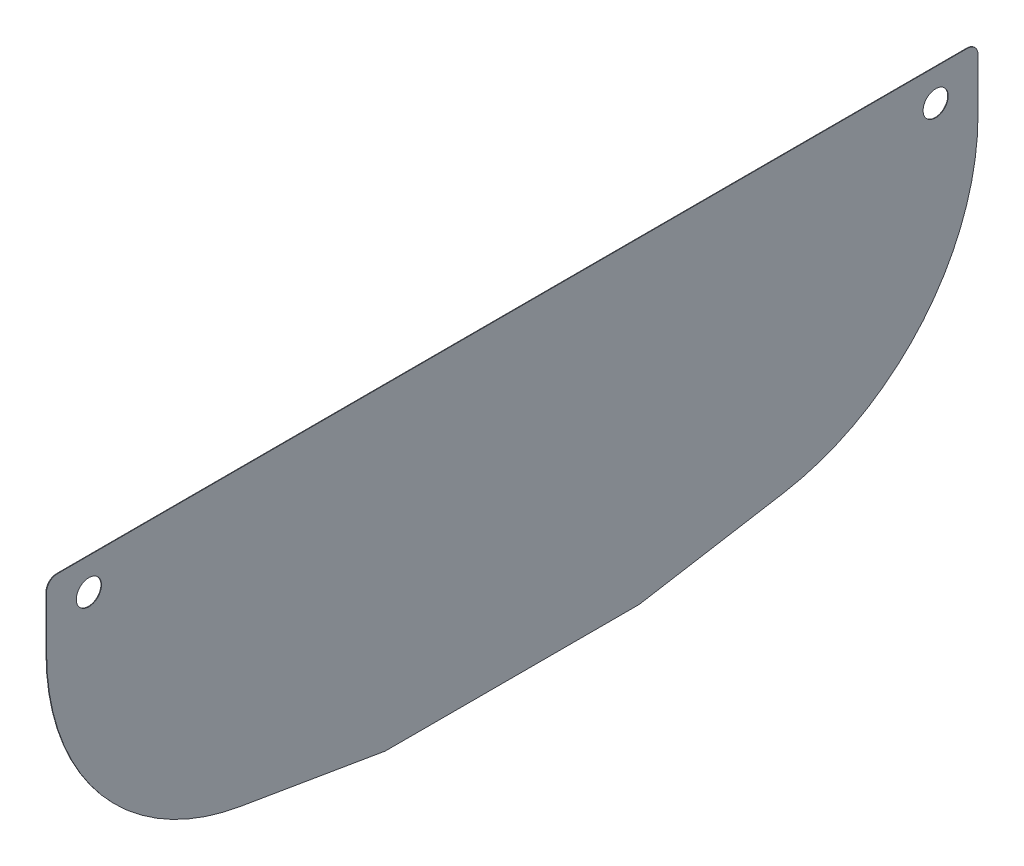
ISO-10303-21;
HEADER;
FILE_DESCRIPTION(('STEP AP214'),'2;1');
FILE_NAME('part.step','',(''),(''),'','','');
FILE_SCHEMA(('AUTOMOTIVE_DESIGN { 1 0 10303 214 1 1 1 1 }'));
ENDSEC;
DATA;
#1=APPLICATION_CONTEXT('core data for automotive mechanical design processes');
#2=APPLICATION_PROTOCOL_DEFINITION('international standard','automotive_design',2000,#1);
#3=PRODUCT_CONTEXT('',#1,'mechanical');
#4=PRODUCT('Part','Part','',(#3));
#5=PRODUCT_RELATED_PRODUCT_CATEGORY('part','',(#4));
#6=PRODUCT_DEFINITION_FORMATION('','',#4);
#7=PRODUCT_DEFINITION_CONTEXT('part definition',#1,'design');
#8=PRODUCT_DEFINITION('design','',#6,#7);
#9=PRODUCT_DEFINITION_SHAPE('','',#8);
#10=(LENGTH_UNIT() NAMED_UNIT(*) SI_UNIT(.MILLI.,.METRE.));
#11=(NAMED_UNIT(*) PLANE_ANGLE_UNIT() SI_UNIT($,.RADIAN.));
#12=(NAMED_UNIT(*) SI_UNIT($,.STERADIAN.) SOLID_ANGLE_UNIT());
#13=UNCERTAINTY_MEASURE_WITH_UNIT(LENGTH_MEASURE(1.E-05),#10,'distance_accuracy_value','');
#14=(GEOMETRIC_REPRESENTATION_CONTEXT(3) GLOBAL_UNCERTAINTY_ASSIGNED_CONTEXT((#13)) GLOBAL_UNIT_ASSIGNED_CONTEXT((#10,
#11,#12)) REPRESENTATION_CONTEXT('',''));
#15=CARTESIAN_POINT('',(0.,0.,0.));
#16=DIRECTION('',(0.,0.,1.));
#17=DIRECTION('',(1.,0.,0.));
#18=AXIS2_PLACEMENT_3D('',#15,#16,#17);
#19=CARTESIAN_POINT('',(0.635,609.6,-279.4));
#20=DIRECTION('',(1.,0.,0.));
#21=DIRECTION('',(0.,0.,-1.));
#22=AXIS2_PLACEMENT_3D('',#19,#20,#21);
#23=PLANE('',#22);
#24=CARTESIAN_POINT('',(0.635,647.7,508.));
#25=DIRECTION('',(1.,0.,0.));
#26=DIRECTION('',(0.,0.,-1.));
#27=AXIS2_PLACEMENT_3D('',#24,#25,#26);
#28=CIRCLE('',#27,15.08125);
#29=CARTESIAN_POINT('',(0.635,647.7,492.91875));
#30=VERTEX_POINT('',#29);
#31=EDGE_CURVE('E243',#30,#30,#28,.T.);
#32=ORIENTED_EDGE('',*,*,#31,.F.);
#33=EDGE_LOOP('',(#32));
#34=FACE_BOUND('',#33,.T.);
#35=DIRECTION('',(0.,0.,-1.));
#36=VECTOR('',#35,1.);
#37=CARTESIAN_POINT('',(0.635,304.8,-152.4));
#38=LINE('',#37,#36);
#39=CARTESIAN_POINT('',(0.635,304.8,151.335296477196));
#40=VERTEX_POINT('',#39);
#41=CARTESIAN_POINT('',(0.635,304.8,-151.335296477196));
#42=VERTEX_POINT('',#41);
#43=EDGE_CURVE('E236',#40,#42,#38,.T.);
#44=ORIENTED_EDGE('',*,*,#43,.T.);
#45=CARTESIAN_POINT('',(0.635,317.5,-151.335296477196));
#46=DIRECTION('',(1.,0.,0.));
#47=DIRECTION('',(0.,0.,-1.));
#48=AXIS2_PLACEMENT_3D('',#45,#46,#47);
#49=CIRCLE('',#48,12.7);
#50=CARTESIAN_POINT('',(0.635,304.977272750754,-153.449841875385));
#51=VERTEX_POINT('',#50);
#52=EDGE_CURVE('E182',#42,#51,#49,.T.);
#53=ORIENTED_EDGE('',*,*,#52,.T.);
#54=DIRECTION('',(0.,0.166499637652699,-0.986041515688625));
#55=VECTOR('',#54,1.);
#56=CARTESIAN_POINT('',(0.635,304.8,-152.4));
#57=LINE('',#56,#55);
#58=CARTESIAN_POINT('',(0.635,334.100000516598,-325.919998760164));
#59=VERTEX_POINT('',#58);
#60=EDGE_CURVE('E145',#51,#59,#57,.T.);
#61=ORIENTED_EDGE('',*,*,#60,.T.);
#62=CARTESIAN_POINT('',(0.635,609.6,-279.4));
#63=DIRECTION('',(1.,0.,0.));
#64=DIRECTION('',(0.,0.,-1.));
#65=AXIS2_PLACEMENT_3D('',#62,#63,#64);
#66=CIRCLE('',#65,279.4);
#67=CARTESIAN_POINT('',(0.635,609.6,-558.8));
#68=VERTEX_POINT('',#67);
#69=EDGE_CURVE('E139',#59,#68,#66,.T.);
#70=ORIENTED_EDGE('',*,*,#69,.T.);
#71=DIRECTION('',(0.,1.,0.));
#72=VECTOR('',#71,1.);
#73=CARTESIAN_POINT('',(0.635,685.8,-558.8));
#74=LINE('',#73,#72);
#75=CARTESIAN_POINT('',(0.635,673.1,-558.8));
#76=VERTEX_POINT('',#75);
#77=EDGE_CURVE('E129',#68,#76,#74,.T.);
#78=ORIENTED_EDGE('',*,*,#77,.T.);
#79=CARTESIAN_POINT('',(0.635,673.1,-546.1));
#80=DIRECTION('',(1.,0.,0.));
#81=DIRECTION('',(0.,0.,-1.));
#82=AXIS2_PLACEMENT_3D('',#79,#80,#81);
#83=CIRCLE('',#82,12.7);
#84=CARTESIAN_POINT('',(0.635,685.8,-546.1));
#85=VERTEX_POINT('',#84);
#86=EDGE_CURVE('E178',#76,#85,#83,.T.);
#87=ORIENTED_EDGE('',*,*,#86,.T.);
#88=DIRECTION('',(0.,0.,1.));
#89=VECTOR('',#88,1.);
#90=CARTESIAN_POINT('',(0.635,685.8,558.8));
#91=LINE('',#90,#89);
#92=CARTESIAN_POINT('',(0.635,685.8,546.1));
#93=VERTEX_POINT('',#92);
#94=EDGE_CURVE('E138',#85,#93,#91,.T.);
#95=ORIENTED_EDGE('',*,*,#94,.T.);
#96=CARTESIAN_POINT('',(0.635,673.1,546.1));
#97=DIRECTION('',(1.,0.,0.));
#98=DIRECTION('',(0.,0.,-1.));
#99=AXIS2_PLACEMENT_3D('',#96,#97,#98);
#100=CIRCLE('',#99,12.7);
#101=CARTESIAN_POINT('',(0.635,673.1,558.8));
#102=VERTEX_POINT('',#101);
#103=EDGE_CURVE('E60',#93,#102,#100,.T.);
#104=ORIENTED_EDGE('',*,*,#103,.T.);
#105=DIRECTION('',(0.,-1.,0.));
#106=VECTOR('',#105,1.);
#107=CARTESIAN_POINT('',(0.635,609.6,558.8));
#108=LINE('',#107,#106);
#109=CARTESIAN_POINT('',(0.635,609.6,558.8));
#110=VERTEX_POINT('',#109);
#111=EDGE_CURVE('E257',#102,#110,#108,.T.);
#112=ORIENTED_EDGE('',*,*,#111,.T.);
#113=CARTESIAN_POINT('',(0.635,609.6,279.4));
#114=DIRECTION('',(1.,0.,0.));
#115=DIRECTION('',(0.,0.,1.));
#116=AXIS2_PLACEMENT_3D('',#113,#114,#115);
#117=CIRCLE('',#116,279.4);
#118=CARTESIAN_POINT('',(0.635,334.100000516598,325.919998760164));
#119=VERTEX_POINT('',#118);
#120=EDGE_CURVE('E240',#110,#119,#117,.T.);
#121=ORIENTED_EDGE('',*,*,#120,.T.);
#122=DIRECTION('',(0.,-0.166499637652699,-0.986041515688625));
#123=VECTOR('',#122,1.);
#124=CARTESIAN_POINT('',(0.635,304.8,152.4));
#125=LINE('',#124,#123);
#126=CARTESIAN_POINT('',(0.635,304.977272750754,153.449841875385));
#127=VERTEX_POINT('',#126);
#128=EDGE_CURVE('E223',#119,#127,#125,.T.);
#129=ORIENTED_EDGE('',*,*,#128,.T.);
#130=CARTESIAN_POINT('',(0.635,317.5,151.335296477196));
#131=DIRECTION('',(1.,0.,0.));
#132=DIRECTION('',(0.,0.,-1.));
#133=AXIS2_PLACEMENT_3D('',#130,#131,#132);
#134=CIRCLE('',#133,12.7);
#135=EDGE_CURVE('E180',#127,#40,#134,.T.);
#136=ORIENTED_EDGE('',*,*,#135,.T.);
#137=EDGE_LOOP('',(#44,#53,#61,#70,#78,#87,#95,#104,#112,#121,#129,#136));
#138=FACE_BOUND('',#137,.T.);
#139=CARTESIAN_POINT('',(0.635,647.7,-508.));
#140=DIRECTION('',(1.,0.,0.));
#141=DIRECTION('',(0.,0.,-1.));
#142=AXIS2_PLACEMENT_3D('',#139,#140,#141);
#143=CIRCLE('',#142,15.0812500000001);
#144=CARTESIAN_POINT('',(0.635,647.7,-523.08125));
#145=VERTEX_POINT('',#144);
#146=EDGE_CURVE('E250',#145,#145,#143,.T.);
#147=ORIENTED_EDGE('',*,*,#146,.F.);
#148=EDGE_LOOP('',(#147));
#149=FACE_BOUND('',#148,.T.);
#150=ADVANCED_FACE('F37',(#34,#138,#149),#23,.T.);
#151=CARTESIAN_POINT('',(0.,609.6,-279.4));
#152=DIRECTION('',(1.,0.,0.));
#153=DIRECTION('',(0.,0.,-1.));
#154=AXIS2_PLACEMENT_3D('',#151,#152,#153);
#155=PLANE('',#154);
#156=DIRECTION('',(0.,0.166499637652699,-0.986041515688625));
#157=VECTOR('',#156,1.);
#158=CARTESIAN_POINT('',(0.,304.8,-152.4));
#159=LINE('',#158,#157);
#160=CARTESIAN_POINT('',(0.,304.977272750754,-153.449841875385));
#161=VERTEX_POINT('',#160);
#162=CARTESIAN_POINT('',(0.,334.100000516598,-325.919998760164));
#163=VERTEX_POINT('',#162);
#164=EDGE_CURVE('E149',#161,#163,#159,.T.);
#165=ORIENTED_EDGE('',*,*,#164,.F.);
#166=CARTESIAN_POINT('',(0.,317.5,-151.335296477196));
#167=DIRECTION('',(1.,0.,0.));
#168=DIRECTION('',(0.,0.,-1.));
#169=AXIS2_PLACEMENT_3D('',#166,#167,#168);
#170=CIRCLE('',#169,12.7);
#171=CARTESIAN_POINT('',(0.,304.8,-151.335296477196));
#172=VERTEX_POINT('',#171);
#173=EDGE_CURVE('E170',#161,#172,#170,.F.);
#174=ORIENTED_EDGE('',*,*,#173,.T.);
#175=DIRECTION('',(0.,0.,-1.));
#176=VECTOR('',#175,1.);
#177=CARTESIAN_POINT('',(0.,304.8,-152.4));
#178=LINE('',#177,#176);
#179=CARTESIAN_POINT('',(0.,304.8,151.335296477196));
#180=VERTEX_POINT('',#179);
#181=EDGE_CURVE('E214',#180,#172,#178,.T.);
#182=ORIENTED_EDGE('',*,*,#181,.F.);
#183=CARTESIAN_POINT('',(0.,317.5,151.335296477196));
#184=DIRECTION('',(1.,0.,0.));
#185=DIRECTION('',(0.,0.,-1.));
#186=AXIS2_PLACEMENT_3D('',#183,#184,#185);
#187=CIRCLE('',#186,12.7);
#188=CARTESIAN_POINT('',(0.,304.977272750754,153.449841875385));
#189=VERTEX_POINT('',#188);
#190=EDGE_CURVE('E168',#180,#189,#187,.F.);
#191=ORIENTED_EDGE('',*,*,#190,.T.);
#192=DIRECTION('',(0.,-0.166499637652699,-0.986041515688625));
#193=VECTOR('',#192,1.);
#194=CARTESIAN_POINT('',(0.,304.8,152.4));
#195=LINE('',#194,#193);
#196=CARTESIAN_POINT('',(0.,334.100000516598,325.919998760164));
#197=VERTEX_POINT('',#196);
#198=EDGE_CURVE('E212',#197,#189,#195,.T.);
#199=ORIENTED_EDGE('',*,*,#198,.F.);
#200=CARTESIAN_POINT('',(0.,609.6,279.4));
#201=DIRECTION('',(1.,0.,0.));
#202=DIRECTION('',(0.,0.,1.));
#203=AXIS2_PLACEMENT_3D('',#200,#201,#202);
#204=CIRCLE('',#203,279.4);
#205=CARTESIAN_POINT('',(0.,609.6,558.8));
#206=VERTEX_POINT('',#205);
#207=EDGE_CURVE('E206',#206,#197,#204,.T.);
#208=ORIENTED_EDGE('',*,*,#207,.F.);
#209=DIRECTION('',(0.,-1.,0.));
#210=VECTOR('',#209,1.);
#211=CARTESIAN_POINT('',(0.,609.6,558.8));
#212=LINE('',#211,#210);
#213=CARTESIAN_POINT('',(0.,673.1,558.8));
#214=VERTEX_POINT('',#213);
#215=EDGE_CURVE('E203',#214,#206,#212,.T.);
#216=ORIENTED_EDGE('',*,*,#215,.F.);
#217=CARTESIAN_POINT('',(0.,673.1,546.1));
#218=DIRECTION('',(1.,0.,0.));
#219=DIRECTION('',(0.,0.,-1.));
#220=AXIS2_PLACEMENT_3D('',#217,#218,#219);
#221=CIRCLE('',#220,12.7);
#222=CARTESIAN_POINT('',(0.,685.8,546.1));
#223=VERTEX_POINT('',#222);
#224=EDGE_CURVE('E158',#214,#223,#221,.F.);
#225=ORIENTED_EDGE('',*,*,#224,.T.);
#226=DIRECTION('',(0.,0.,1.));
#227=VECTOR('',#226,1.);
#228=CARTESIAN_POINT('',(0.,685.8,558.8));
#229=LINE('',#228,#227);
#230=CARTESIAN_POINT('',(0.,685.8,-546.1));
#231=VERTEX_POINT('',#230);
#232=EDGE_CURVE('E195',#231,#223,#229,.T.);
#233=ORIENTED_EDGE('',*,*,#232,.F.);
#234=CARTESIAN_POINT('',(0.,673.1,-546.1));
#235=DIRECTION('',(1.,0.,0.));
#236=DIRECTION('',(0.,0.,-1.));
#237=AXIS2_PLACEMENT_3D('',#234,#235,#236);
#238=CIRCLE('',#237,12.7);
#239=CARTESIAN_POINT('',(0.,673.1,-558.8));
#240=VERTEX_POINT('',#239);
#241=EDGE_CURVE('E166',#231,#240,#238,.F.);
#242=ORIENTED_EDGE('',*,*,#241,.T.);
#243=DIRECTION('',(0.,1.,0.));
#244=VECTOR('',#243,1.);
#245=CARTESIAN_POINT('',(0.,685.8,-558.8));
#246=LINE('',#245,#244);
#247=CARTESIAN_POINT('',(0.,609.6,-558.8));
#248=VERTEX_POINT('',#247);
#249=EDGE_CURVE('E204',#248,#240,#246,.T.);
#250=ORIENTED_EDGE('',*,*,#249,.F.);
#251=CARTESIAN_POINT('',(0.,609.6,-279.4));
#252=DIRECTION('',(1.,0.,0.));
#253=DIRECTION('',(0.,0.,-1.));
#254=AXIS2_PLACEMENT_3D('',#251,#252,#253);
#255=CIRCLE('',#254,279.4);
#256=EDGE_CURVE('E153',#163,#248,#255,.T.);
#257=ORIENTED_EDGE('',*,*,#256,.F.);
#258=EDGE_LOOP('',(#165,#174,#182,#191,#199,#208,#216,#225,#233,#242,#250,#257));
#259=FACE_BOUND('',#258,.T.);
#260=CARTESIAN_POINT('',(0.,647.7,508.));
#261=DIRECTION('',(1.,0.,0.));
#262=DIRECTION('',(0.,0.,-1.));
#263=AXIS2_PLACEMENT_3D('',#260,#261,#262);
#264=CIRCLE('',#263,15.08125);
#265=CARTESIAN_POINT('',(0.,647.7,492.91875));
#266=VERTEX_POINT('',#265);
#267=EDGE_CURVE('E245',#266,#266,#264,.T.);
#268=ORIENTED_EDGE('',*,*,#267,.T.);
#269=EDGE_LOOP('',(#268));
#270=FACE_BOUND('',#269,.T.);
#271=CARTESIAN_POINT('',(0.,647.7,-508.));
#272=DIRECTION('',(1.,0.,0.));
#273=DIRECTION('',(0.,0.,-1.));
#274=AXIS2_PLACEMENT_3D('',#271,#272,#273);
#275=CIRCLE('',#274,15.0812500000001);
#276=CARTESIAN_POINT('',(0.,647.7,-523.08125));
#277=VERTEX_POINT('',#276);
#278=EDGE_CURVE('E253',#277,#277,#275,.T.);
#279=ORIENTED_EDGE('',*,*,#278,.T.);
#280=EDGE_LOOP('',(#279));
#281=FACE_BOUND('',#280,.T.);
#282=ADVANCED_FACE('F200',(#259,#270,#281),#155,.F.);
#283=CARTESIAN_POINT('',(0.635,609.6,-279.4));
#284=DIRECTION('',(-1.,0.,0.));
#285=DIRECTION('',(0.,0.,1.));
#286=AXIS2_PLACEMENT_3D('',#283,#284,#285);
#287=CYLINDRICAL_SURFACE('',#286,279.4);
#288=ORIENTED_EDGE('',*,*,#256,.T.);
#289=DIRECTION('',(-1.,0.,0.));
#290=VECTOR('',#289,1.);
#291=CARTESIAN_POINT('',(0.635,609.6,-558.8));
#292=LINE('',#291,#290);
#293=EDGE_CURVE('E134',#68,#248,#292,.T.);
#294=ORIENTED_EDGE('',*,*,#293,.F.);
#295=ORIENTED_EDGE('',*,*,#69,.F.);
#296=DIRECTION('',(-1.,0.,0.));
#297=VECTOR('',#296,1.);
#298=CARTESIAN_POINT('',(0.635,334.100000516598,-325.919998760164));
#299=LINE('',#298,#297);
#300=EDGE_CURVE('E218',#59,#163,#299,.T.);
#301=ORIENTED_EDGE('',*,*,#300,.T.);
#302=EDGE_LOOP('',(#288,#294,#295,#301));
#303=FACE_BOUND('',#302,.T.);
#304=ADVANCED_FACE('F151',(#303),#287,.T.);
#305=CARTESIAN_POINT('',(0.635,685.8,-558.8));
#306=DIRECTION('',(0.,0.,1.));
#307=DIRECTION('',(0.,-1.,0.));
#308=AXIS2_PLACEMENT_3D('',#305,#306,#307);
#309=PLANE('',#308);
#310=ORIENTED_EDGE('',*,*,#249,.T.);
#311=DIRECTION('',(-1.,0.,0.));
#312=VECTOR('',#311,1.);
#313=CARTESIAN_POINT('',(0.635,673.1,-558.8));
#314=LINE('',#313,#312);
#315=EDGE_CURVE('E45',#240,#76,#314,.F.);
#316=ORIENTED_EDGE('',*,*,#315,.T.);
#317=ORIENTED_EDGE('',*,*,#77,.F.);
#318=ORIENTED_EDGE('',*,*,#293,.T.);
#319=EDGE_LOOP('',(#310,#316,#317,#318));
#320=FACE_BOUND('',#319,.T.);
#321=ADVANCED_FACE('F132',(#320),#309,.F.);
#322=CARTESIAN_POINT('',(0.635,685.8,558.8));
#323=DIRECTION('',(0.,-1.,0.));
#324=DIRECTION('',(0.,0.,-1.));
#325=AXIS2_PLACEMENT_3D('',#322,#323,#324);
#326=PLANE('',#325);
#327=ORIENTED_EDGE('',*,*,#94,.F.);
#328=DIRECTION('',(-1.,0.,0.));
#329=VECTOR('',#328,1.);
#330=CARTESIAN_POINT('',(0.635,685.8,-546.1));
#331=LINE('',#330,#329);
#332=EDGE_CURVE('E187',#85,#231,#331,.T.);
#333=ORIENTED_EDGE('',*,*,#332,.T.);
#334=ORIENTED_EDGE('',*,*,#232,.T.);
#335=DIRECTION('',(-1.,0.,0.));
#336=VECTOR('',#335,1.);
#337=CARTESIAN_POINT('',(0.635,685.8,546.1));
#338=LINE('',#337,#336);
#339=EDGE_CURVE('E185',#223,#93,#338,.F.);
#340=ORIENTED_EDGE('',*,*,#339,.T.);
#341=EDGE_LOOP('',(#327,#333,#334,#340));
#342=FACE_BOUND('',#341,.T.);
#343=ADVANCED_FACE('F194',(#342),#326,.F.);
#344=CARTESIAN_POINT('',(0.635,609.6,558.8));
#345=DIRECTION('',(0.,0.,-1.));
#346=DIRECTION('',(0.,1.,0.));
#347=AXIS2_PLACEMENT_3D('',#344,#345,#346);
#348=PLANE('',#347);
#349=ORIENTED_EDGE('',*,*,#111,.F.);
#350=DIRECTION('',(-1.,0.,0.));
#351=VECTOR('',#350,1.);
#352=CARTESIAN_POINT('',(0.635,673.1,558.8));
#353=LINE('',#352,#351);
#354=EDGE_CURVE('E11',#102,#214,#353,.T.);
#355=ORIENTED_EDGE('',*,*,#354,.T.);
#356=ORIENTED_EDGE('',*,*,#215,.T.);
#357=DIRECTION('',(-1.,0.,0.));
#358=VECTOR('',#357,1.);
#359=CARTESIAN_POINT('',(0.635,609.6,558.8));
#360=LINE('',#359,#358);
#361=EDGE_CURVE('E155',#110,#206,#360,.T.);
#362=ORIENTED_EDGE('',*,*,#361,.F.);
#363=EDGE_LOOP('',(#349,#355,#356,#362));
#364=FACE_BOUND('',#363,.T.);
#365=ADVANCED_FACE('F261',(#364),#348,.F.);
#366=CARTESIAN_POINT('',(0.635,609.6,279.4));
#367=DIRECTION('',(-1.,0.,0.));
#368=DIRECTION('',(0.,0.,1.));
#369=AXIS2_PLACEMENT_3D('',#366,#367,#368);
#370=CYLINDRICAL_SURFACE('',#369,279.4);
#371=ORIENTED_EDGE('',*,*,#207,.T.);
#372=DIRECTION('',(-1.,0.,0.));
#373=VECTOR('',#372,1.);
#374=CARTESIAN_POINT('',(0.635,334.100000516598,325.919998760164));
#375=LINE('',#374,#373);
#376=EDGE_CURVE('E161',#119,#197,#375,.T.);
#377=ORIENTED_EDGE('',*,*,#376,.F.);
#378=ORIENTED_EDGE('',*,*,#120,.F.);
#379=ORIENTED_EDGE('',*,*,#361,.T.);
#380=EDGE_LOOP('',(#371,#377,#378,#379));
#381=FACE_BOUND('',#380,.T.);
#382=ADVANCED_FACE('F259',(#381),#370,.T.);
#383=CARTESIAN_POINT('',(0.635,304.8,152.4));
#384=DIRECTION('',(0.,0.986041515688624,-0.166499637652699));
#385=DIRECTION('',(0.,0.166499637652699,0.986041515688625));
#386=AXIS2_PLACEMENT_3D('',#383,#384,#385);
#387=PLANE('',#386);
#388=ORIENTED_EDGE('',*,*,#198,.T.);
#389=DIRECTION('',(-1.,0.,0.));
#390=VECTOR('',#389,1.);
#391=CARTESIAN_POINT('',(0.635,304.977272750754,153.449841875385));
#392=LINE('',#391,#390);
#393=EDGE_CURVE('E52',#189,#127,#392,.F.);
#394=ORIENTED_EDGE('',*,*,#393,.T.);
#395=ORIENTED_EDGE('',*,*,#128,.F.);
#396=ORIENTED_EDGE('',*,*,#376,.T.);
#397=EDGE_LOOP('',(#388,#394,#395,#396));
#398=FACE_BOUND('',#397,.T.);
#399=ADVANCED_FACE('F222',(#398),#387,.F.);
#400=CARTESIAN_POINT('',(0.635,304.8,-152.4));
#401=DIRECTION('',(0.,1.,0.));
#402=DIRECTION('',(0.,0.,1.));
#403=AXIS2_PLACEMENT_3D('',#400,#401,#402);
#404=PLANE('',#403);
#405=ORIENTED_EDGE('',*,*,#181,.T.);
#406=DIRECTION('',(-1.,0.,0.));
#407=VECTOR('',#406,1.);
#408=CARTESIAN_POINT('',(0.635,304.8,-151.335296477196));
#409=LINE('',#408,#407);
#410=EDGE_CURVE('E175',#172,#42,#409,.F.);
#411=ORIENTED_EDGE('',*,*,#410,.T.);
#412=ORIENTED_EDGE('',*,*,#43,.F.);
#413=DIRECTION('',(-1.,0.,0.));
#414=VECTOR('',#413,1.);
#415=CARTESIAN_POINT('',(0.635,304.8,151.335296477196));
#416=LINE('',#415,#414);
#417=EDGE_CURVE('E172',#40,#180,#416,.T.);
#418=ORIENTED_EDGE('',*,*,#417,.T.);
#419=EDGE_LOOP('',(#405,#411,#412,#418));
#420=FACE_BOUND('',#419,.T.);
#421=ADVANCED_FACE('F234',(#420),#404,.F.);
#422=CARTESIAN_POINT('',(0.635,304.8,-152.4));
#423=DIRECTION('',(0.,0.986041515688624,0.166499637652699));
#424=DIRECTION('',(0.,-0.166499637652699,0.986041515688625));
#425=AXIS2_PLACEMENT_3D('',#422,#423,#424);
#426=PLANE('',#425);
#427=ORIENTED_EDGE('',*,*,#60,.F.);
#428=DIRECTION('',(-1.,0.,0.));
#429=VECTOR('',#428,1.);
#430=CARTESIAN_POINT('',(0.635,304.977272750754,-153.449841875385));
#431=LINE('',#430,#429);
#432=EDGE_CURVE('E154',#51,#161,#431,.T.);
#433=ORIENTED_EDGE('',*,*,#432,.T.);
#434=ORIENTED_EDGE('',*,*,#164,.T.);
#435=ORIENTED_EDGE('',*,*,#300,.F.);
#436=EDGE_LOOP('',(#427,#433,#434,#435));
#437=FACE_BOUND('',#436,.T.);
#438=ADVANCED_FACE('F284',(#437),#426,.F.);
#439=CARTESIAN_POINT('',(0.635,647.7,508.));
#440=DIRECTION('',(-1.,0.,0.));
#441=DIRECTION('',(0.,0.,1.));
#442=AXIS2_PLACEMENT_3D('',#439,#440,#441);
#443=CYLINDRICAL_SURFACE('',#442,15.08125);
#444=ORIENTED_EDGE('',*,*,#31,.T.);
#445=EDGE_LOOP('',(#444));
#446=FACE_BOUND('',#445,.T.);
#447=ORIENTED_EDGE('',*,*,#267,.F.);
#448=EDGE_LOOP('',(#447));
#449=FACE_BOUND('',#448,.T.);
#450=ADVANCED_FACE('F281',(#446,#449),#443,.F.);
#451=CARTESIAN_POINT('',(0.635,647.7,-508.));
#452=DIRECTION('',(-1.,0.,0.));
#453=DIRECTION('',(0.,0.,1.));
#454=AXIS2_PLACEMENT_3D('',#451,#452,#453);
#455=CYLINDRICAL_SURFACE('',#454,15.0812500000001);
#456=ORIENTED_EDGE('',*,*,#146,.T.);
#457=EDGE_LOOP('',(#456));
#458=FACE_BOUND('',#457,.T.);
#459=ORIENTED_EDGE('',*,*,#278,.F.);
#460=EDGE_LOOP('',(#459));
#461=FACE_BOUND('',#460,.T.);
#462=ADVANCED_FACE('F303',(#458,#461),#455,.F.);
#463=CARTESIAN_POINT('',(0.635,317.5,-151.335296477196));
#464=DIRECTION('',(-1.,0.,0.));
#465=DIRECTION('',(0.,0.,1.));
#466=AXIS2_PLACEMENT_3D('',#463,#464,#465);
#467=CYLINDRICAL_SURFACE('',#466,12.7);
#468=ORIENTED_EDGE('',*,*,#52,.F.);
#469=ORIENTED_EDGE('',*,*,#410,.F.);
#470=ORIENTED_EDGE('',*,*,#173,.F.);
#471=ORIENTED_EDGE('',*,*,#432,.F.);
#472=EDGE_LOOP('',(#468,#469,#470,#471));
#473=FACE_BOUND('',#472,.T.);
#474=ADVANCED_FACE('F270',(#473),#467,.T.);
#475=CARTESIAN_POINT('',(0.635,317.5,151.335296477196));
#476=DIRECTION('',(-1.,0.,0.));
#477=DIRECTION('',(0.,0.,1.));
#478=AXIS2_PLACEMENT_3D('',#475,#476,#477);
#479=CYLINDRICAL_SURFACE('',#478,12.7);
#480=ORIENTED_EDGE('',*,*,#135,.F.);
#481=ORIENTED_EDGE('',*,*,#393,.F.);
#482=ORIENTED_EDGE('',*,*,#190,.F.);
#483=ORIENTED_EDGE('',*,*,#417,.F.);
#484=EDGE_LOOP('',(#480,#481,#482,#483));
#485=FACE_BOUND('',#484,.T.);
#486=ADVANCED_FACE('F231',(#485),#479,.T.);
#487=CARTESIAN_POINT('',(0.635,673.1,-546.1));
#488=DIRECTION('',(-1.,0.,0.));
#489=DIRECTION('',(0.,0.,1.));
#490=AXIS2_PLACEMENT_3D('',#487,#488,#489);
#491=CYLINDRICAL_SURFACE('',#490,12.7);
#492=ORIENTED_EDGE('',*,*,#86,.F.);
#493=ORIENTED_EDGE('',*,*,#315,.F.);
#494=ORIENTED_EDGE('',*,*,#241,.F.);
#495=ORIENTED_EDGE('',*,*,#332,.F.);
#496=EDGE_LOOP('',(#492,#493,#494,#495));
#497=FACE_BOUND('',#496,.T.);
#498=ADVANCED_FACE('F264',(#497),#491,.T.);
#499=CARTESIAN_POINT('',(0.635,673.1,546.1));
#500=DIRECTION('',(-1.,0.,0.));
#501=DIRECTION('',(0.,0.,1.));
#502=AXIS2_PLACEMENT_3D('',#499,#500,#501);
#503=CYLINDRICAL_SURFACE('',#502,12.7);
#504=ORIENTED_EDGE('',*,*,#103,.F.);
#505=ORIENTED_EDGE('',*,*,#339,.F.);
#506=ORIENTED_EDGE('',*,*,#224,.F.);
#507=ORIENTED_EDGE('',*,*,#354,.F.);
#508=EDGE_LOOP('',(#504,#505,#506,#507));
#509=FACE_BOUND('',#508,.T.);
#510=ADVANCED_FACE('F39',(#509),#503,.T.);
#511=CLOSED_SHELL('',(#150,#282,#304,#321,#343,#365,#382,#399,#421,#438,#450,#462,#474,#486,
#498,#510));
#512=MANIFOLD_SOLID_BREP('B2',#511);
#513=ADVANCED_BREP_SHAPE_REPRESENTATION('',(#18,#512),#14);
#514=SHAPE_DEFINITION_REPRESENTATION(#9,#513);
ENDSEC;
END-ISO-10303-21;
